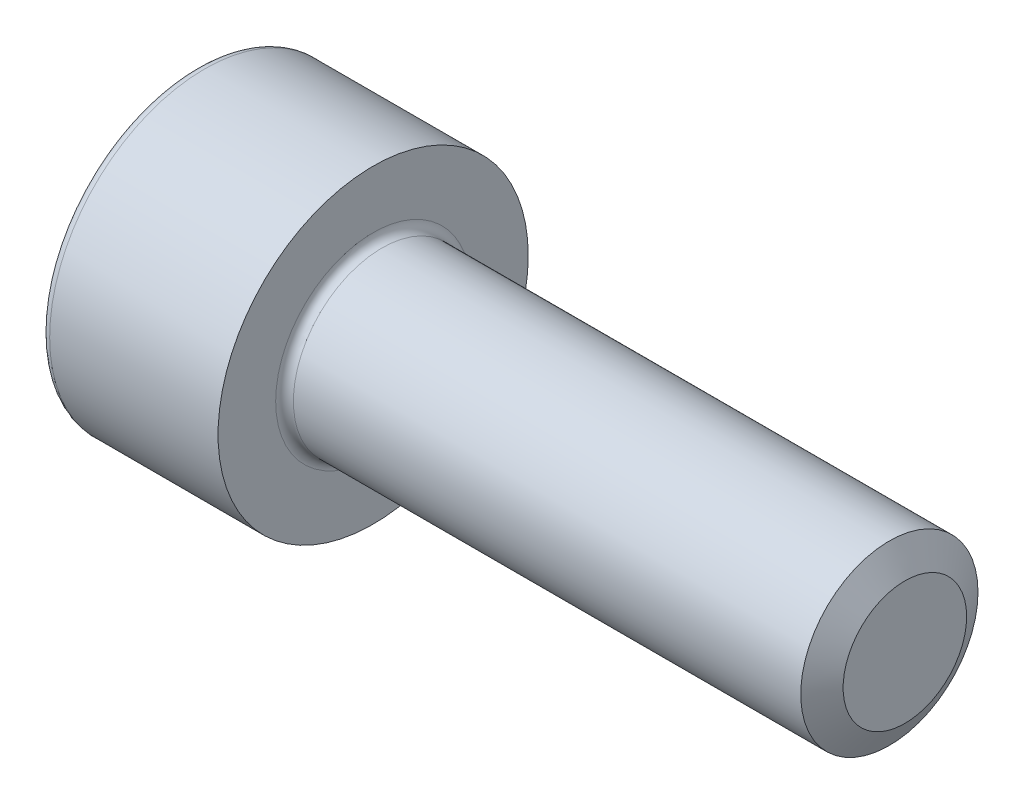
ISO-10303-21;
HEADER;
FILE_DESCRIPTION(('STEP AP214'),'2;1');
FILE_NAME('part.step','',(''),(''),'','','');
FILE_SCHEMA(('AUTOMOTIVE_DESIGN { 1 0 10303 214 1 1 1 1 }'));
ENDSEC;
DATA;
#1=APPLICATION_CONTEXT('core data for automotive mechanical design processes');
#2=APPLICATION_PROTOCOL_DEFINITION('international standard','automotive_design',2000,#1);
#3=PRODUCT_CONTEXT('',#1,'mechanical');
#4=PRODUCT('Part','Part','',(#3));
#5=PRODUCT_RELATED_PRODUCT_CATEGORY('part','',(#4));
#6=PRODUCT_DEFINITION_FORMATION('','',#4);
#7=PRODUCT_DEFINITION_CONTEXT('part definition',#1,'design');
#8=PRODUCT_DEFINITION('design','',#6,#7);
#9=PRODUCT_DEFINITION_SHAPE('','',#8);
#10=(LENGTH_UNIT() NAMED_UNIT(*) SI_UNIT(.MILLI.,.METRE.));
#11=(NAMED_UNIT(*) PLANE_ANGLE_UNIT() SI_UNIT($,.RADIAN.));
#12=(NAMED_UNIT(*) SI_UNIT($,.STERADIAN.) SOLID_ANGLE_UNIT());
#13=UNCERTAINTY_MEASURE_WITH_UNIT(LENGTH_MEASURE(1.E-05),#10,'distance_accuracy_value','');
#14=(GEOMETRIC_REPRESENTATION_CONTEXT(3) GLOBAL_UNCERTAINTY_ASSIGNED_CONTEXT((#13)) GLOBAL_UNIT_ASSIGNED_CONTEXT((#10,
#11,#12)) REPRESENTATION_CONTEXT('',''));
#15=CARTESIAN_POINT('',(0.,0.,0.));
#16=DIRECTION('',(0.,0.,1.));
#17=DIRECTION('',(1.,0.,0.));
#18=AXIS2_PLACEMENT_3D('',#15,#16,#17);
#19=CARTESIAN_POINT('',(0.,0.,0.));
#20=DIRECTION('',(1.,0.,0.));
#21=DIRECTION('',(0.,0.,-1.));
#22=AXIS2_PLACEMENT_3D('',#19,#20,#21);
#23=CYLINDRICAL_SURFACE('',#22,3.5);
#24=CARTESIAN_POINT('',(0.2,0.,0.));
#25=DIRECTION('',(-1.,0.,0.));
#26=DIRECTION('',(0.,0.,1.));
#27=AXIS2_PLACEMENT_3D('',#24,#25,#26);
#28=CIRCLE('',#27,3.5);
#29=CARTESIAN_POINT('',(0.2,0.,3.5));
#30=VERTEX_POINT('',#29);
#31=EDGE_CURVE('E44',#30,#30,#28,.F.);
#32=ORIENTED_EDGE('',*,*,#31,.T.);
#33=EDGE_LOOP('',(#32));
#34=FACE_BOUND('',#33,.T.);
#35=CARTESIAN_POINT('',(4.,0.,0.));
#36=DIRECTION('',(1.,0.,0.));
#37=DIRECTION('',(0.,0.,-1.));
#38=AXIS2_PLACEMENT_3D('',#35,#36,#37);
#39=CIRCLE('',#38,3.5);
#40=CARTESIAN_POINT('',(4.,0.,-3.5));
#41=VERTEX_POINT('',#40);
#42=EDGE_CURVE('E138',#41,#41,#39,.T.);
#43=ORIENTED_EDGE('',*,*,#42,.F.);
#44=EDGE_LOOP('',(#43));
#45=FACE_BOUND('',#44,.T.);
#46=ADVANCED_FACE('F36',(#34,#45),#23,.T.);
#47=CARTESIAN_POINT('',(0.,3.5,0.));
#48=DIRECTION('',(-1.,0.,0.));
#49=DIRECTION('',(0.,0.,1.));
#50=AXIS2_PLACEMENT_3D('',#47,#48,#49);
#51=PLANE('',#50);
#52=CARTESIAN_POINT('',(0.,0.,0.));
#53=DIRECTION('',(-1.,0.,0.));
#54=DIRECTION('',(0.,0.,1.));
#55=AXIS2_PLACEMENT_3D('',#52,#53,#54);
#56=CIRCLE('',#55,3.3);
#57=CARTESIAN_POINT('',(0.,0.,3.3));
#58=VERTEX_POINT('',#57);
#59=EDGE_CURVE('E11',#58,#58,#56,.T.);
#60=ORIENTED_EDGE('',*,*,#59,.T.);
#61=EDGE_LOOP('',(#60));
#62=FACE_BOUND('',#61,.T.);
#63=DIRECTION('',(0.,0.5,-0.866025403784439));
#64=VECTOR('',#63,1.);
#65=CARTESIAN_POINT('',(0.,0.860000000000001,1.48956369450923));
#66=LINE('',#65,#64);
#67=CARTESIAN_POINT('',(0.,0.860000000000001,1.48956369450923));
#68=VERTEX_POINT('',#67);
#69=CARTESIAN_POINT('',(0.,1.72,0.));
#70=VERTEX_POINT('',#69);
#71=EDGE_CURVE('E51',#68,#70,#66,.T.);
#72=ORIENTED_EDGE('',*,*,#71,.F.);
#73=DIRECTION('',(0.,1.,0.));
#74=VECTOR('',#73,1.);
#75=CARTESIAN_POINT('',(0.,-0.86,1.48956369450923));
#76=LINE('',#75,#74);
#77=CARTESIAN_POINT('',(0.,-0.86,1.48956369450923));
#78=VERTEX_POINT('',#77);
#79=EDGE_CURVE('E134',#78,#68,#76,.T.);
#80=ORIENTED_EDGE('',*,*,#79,.F.);
#81=DIRECTION('',(0.,0.5,0.866025403784439));
#82=VECTOR('',#81,1.);
#83=CARTESIAN_POINT('',(0.,-1.72,0.));
#84=LINE('',#83,#82);
#85=CARTESIAN_POINT('',(0.,-1.72,0.));
#86=VERTEX_POINT('',#85);
#87=EDGE_CURVE('E132',#86,#78,#84,.T.);
#88=ORIENTED_EDGE('',*,*,#87,.F.);
#89=DIRECTION('',(0.,-0.5,0.866025403784438));
#90=VECTOR('',#89,1.);
#91=CARTESIAN_POINT('',(0.,-0.86,-1.48956369450923));
#92=LINE('',#91,#90);
#93=CARTESIAN_POINT('',(0.,-0.86,-1.48956369450923));
#94=VERTEX_POINT('',#93);
#95=EDGE_CURVE('E99',#94,#86,#92,.T.);
#96=ORIENTED_EDGE('',*,*,#95,.F.);
#97=DIRECTION('',(0.,-1.,0.));
#98=VECTOR('',#97,1.);
#99=CARTESIAN_POINT('',(0.,0.86,-1.48956369450923));
#100=LINE('',#99,#98);
#101=CARTESIAN_POINT('',(0.,0.86,-1.48956369450923));
#102=VERTEX_POINT('',#101);
#103=EDGE_CURVE('E128',#102,#94,#100,.T.);
#104=ORIENTED_EDGE('',*,*,#103,.F.);
#105=DIRECTION('',(0.,-0.5,-0.866025403784439));
#106=VECTOR('',#105,1.);
#107=CARTESIAN_POINT('',(0.,1.72,0.));
#108=LINE('',#107,#106);
#109=EDGE_CURVE('E125',#70,#102,#108,.T.);
#110=ORIENTED_EDGE('',*,*,#109,.F.);
#111=EDGE_LOOP('',(#72,#80,#88,#96,#104,#110));
#112=FACE_BOUND('',#111,.T.);
#113=ADVANCED_FACE('F172',(#62,#112),#51,.T.);
#114=CARTESIAN_POINT('',(4.,0.,0.));
#115=DIRECTION('',(1.,0.,0.));
#116=DIRECTION('',(0.,0.,-1.));
#117=AXIS2_PLACEMENT_3D('',#114,#115,#116);
#118=PLANE('',#117);
#119=CARTESIAN_POINT('',(4.,0.,0.));
#120=DIRECTION('',(1.,0.,0.));
#121=DIRECTION('',(0.,0.,-1.));
#122=AXIS2_PLACEMENT_3D('',#119,#120,#121);
#123=CIRCLE('',#122,2.2);
#124=CARTESIAN_POINT('',(4.,0.,-2.2));
#125=VERTEX_POINT('',#124);
#126=EDGE_CURVE('E155',#125,#125,#123,.F.);
#127=ORIENTED_EDGE('',*,*,#126,.T.);
#128=EDGE_LOOP('',(#127));
#129=FACE_BOUND('',#128,.T.);
#130=ORIENTED_EDGE('',*,*,#42,.T.);
#131=EDGE_LOOP('',(#130));
#132=FACE_BOUND('',#131,.T.);
#133=ADVANCED_FACE('F177',(#129,#132),#118,.T.);
#134=CARTESIAN_POINT('',(16.,0.,0.));
#135=DIRECTION('',(-1.,0.,0.));
#136=DIRECTION('',(0.,0.,1.));
#137=AXIS2_PLACEMENT_3D('',#134,#135,#136);
#138=CYLINDRICAL_SURFACE('',#137,2.);
#139=CARTESIAN_POINT('',(4.2,0.,0.));
#140=DIRECTION('',(1.,0.,0.));
#141=DIRECTION('',(0.,0.,-1.));
#142=AXIS2_PLACEMENT_3D('',#139,#140,#141);
#143=CIRCLE('',#142,2.);
#144=CARTESIAN_POINT('',(4.2,0.,-2.));
#145=VERTEX_POINT('',#144);
#146=EDGE_CURVE('E152',#145,#145,#143,.T.);
#147=ORIENTED_EDGE('',*,*,#146,.T.);
#148=EDGE_LOOP('',(#147));
#149=FACE_BOUND('',#148,.T.);
#150=CARTESIAN_POINT('',(15.6500000000051,0.,0.));
#151=DIRECTION('',(1.,0.,0.));
#152=DIRECTION('',(0.,0.,-1.));
#153=AXIS2_PLACEMENT_3D('',#150,#151,#152);
#154=CIRCLE('',#153,2.);
#155=CARTESIAN_POINT('',(15.6500000000051,0.,-2.));
#156=VERTEX_POINT('',#155);
#157=EDGE_CURVE('E149',#156,#156,#154,.F.);
#158=ORIENTED_EDGE('',*,*,#157,.T.);
#159=EDGE_LOOP('',(#158));
#160=FACE_BOUND('',#159,.T.);
#161=ADVANCED_FACE('F199',(#149,#160),#138,.T.);
#162=CARTESIAN_POINT('',(16.,0.,0.));
#163=DIRECTION('',(1.,0.,0.));
#164=DIRECTION('',(0.,0.,-1.));
#165=AXIS2_PLACEMENT_3D('',#162,#163,#164);
#166=PLANE('',#165);
#167=CARTESIAN_POINT('',(16.,0.,0.));
#168=DIRECTION('',(1.,0.,0.));
#169=DIRECTION('',(0.,0.,-1.));
#170=AXIS2_PLACEMENT_3D('',#167,#168,#169);
#171=CIRCLE('',#170,1.39380000004539);
#172=CARTESIAN_POINT('',(16.,0.,-1.39380000004539));
#173=VERTEX_POINT('',#172);
#174=EDGE_CURVE('E146',#173,#173,#171,.T.);
#175=ORIENTED_EDGE('',*,*,#174,.T.);
#176=EDGE_LOOP('',(#175));
#177=FACE_BOUND('',#176,.T.);
#178=ADVANCED_FACE('F196',(#177),#166,.T.);
#179=CARTESIAN_POINT('',(2.,0.860000000000001,1.48956369450923));
#180=DIRECTION('',(0.,0.866025403784439,0.5));
#181=DIRECTION('',(0.,-0.5,0.866025403784439));
#182=AXIS2_PLACEMENT_3D('',#179,#180,#181);
#183=PLANE('',#182);
#184=ORIENTED_EDGE('',*,*,#71,.T.);
#185=DIRECTION('',(-1.,0.,0.));
#186=VECTOR('',#185,1.);
#187=CARTESIAN_POINT('',(2.,1.72,0.));
#188=LINE('',#187,#186);
#189=CARTESIAN_POINT('',(2.,1.72,0.));
#190=VERTEX_POINT('',#189);
#191=EDGE_CURVE('E81',#190,#70,#188,.T.);
#192=ORIENTED_EDGE('',*,*,#191,.F.);
#193=DIRECTION('',(0.,0.5,-0.866025403784439));
#194=VECTOR('',#193,1.);
#195=CARTESIAN_POINT('',(2.,0.860000000000001,1.48956369450923));
#196=LINE('',#195,#194);
#197=CARTESIAN_POINT('',(2.,0.860000000000001,1.48956369450923));
#198=VERTEX_POINT('',#197);
#199=EDGE_CURVE('E136',#198,#190,#196,.T.);
#200=ORIENTED_EDGE('',*,*,#199,.F.);
#201=DIRECTION('',(-1.,0.,0.));
#202=VECTOR('',#201,1.);
#203=CARTESIAN_POINT('',(2.,0.860000000000001,1.48956369450923));
#204=LINE('',#203,#202);
#205=EDGE_CURVE('E59',#198,#68,#204,.T.);
#206=ORIENTED_EDGE('',*,*,#205,.T.);
#207=EDGE_LOOP('',(#184,#192,#200,#206));
#208=FACE_BOUND('',#207,.T.);
#209=ADVANCED_FACE('F198',(#208),#183,.F.);
#210=CARTESIAN_POINT('',(2.,-0.86,1.48956369450923));
#211=DIRECTION('',(0.,0.,1.));
#212=DIRECTION('',(0.,-1.,0.));
#213=AXIS2_PLACEMENT_3D('',#210,#211,#212);
#214=PLANE('',#213);
#215=ORIENTED_EDGE('',*,*,#79,.T.);
#216=ORIENTED_EDGE('',*,*,#205,.F.);
#217=DIRECTION('',(0.,1.,0.));
#218=VECTOR('',#217,1.);
#219=CARTESIAN_POINT('',(2.,-0.86,1.48956369450923));
#220=LINE('',#219,#218);
#221=CARTESIAN_POINT('',(2.,-0.86,1.48956369450923));
#222=VERTEX_POINT('',#221);
#223=EDGE_CURVE('E111',#222,#198,#220,.T.);
#224=ORIENTED_EDGE('',*,*,#223,.F.);
#225=DIRECTION('',(-1.,0.,0.));
#226=VECTOR('',#225,1.);
#227=CARTESIAN_POINT('',(2.,-0.86,1.48956369450923));
#228=LINE('',#227,#226);
#229=EDGE_CURVE('E103',#222,#78,#228,.T.);
#230=ORIENTED_EDGE('',*,*,#229,.T.);
#231=EDGE_LOOP('',(#215,#216,#224,#230));
#232=FACE_BOUND('',#231,.T.);
#233=ADVANCED_FACE('F205',(#232),#214,.F.);
#234=CARTESIAN_POINT('',(2.,-1.72,0.));
#235=DIRECTION('',(0.,-0.866025403784439,0.5));
#236=DIRECTION('',(0.,-0.5,-0.866025403784439));
#237=AXIS2_PLACEMENT_3D('',#234,#235,#236);
#238=PLANE('',#237);
#239=ORIENTED_EDGE('',*,*,#87,.T.);
#240=ORIENTED_EDGE('',*,*,#229,.F.);
#241=DIRECTION('',(0.,0.5,0.866025403784439));
#242=VECTOR('',#241,1.);
#243=CARTESIAN_POINT('',(2.,-1.72,0.));
#244=LINE('',#243,#242);
#245=CARTESIAN_POINT('',(2.,-1.72,0.));
#246=VERTEX_POINT('',#245);
#247=EDGE_CURVE('E107',#246,#222,#244,.T.);
#248=ORIENTED_EDGE('',*,*,#247,.F.);
#249=DIRECTION('',(-1.,0.,0.));
#250=VECTOR('',#249,1.);
#251=CARTESIAN_POINT('',(2.,-1.72,0.));
#252=LINE('',#251,#250);
#253=EDGE_CURVE('E92',#246,#86,#252,.T.);
#254=ORIENTED_EDGE('',*,*,#253,.T.);
#255=EDGE_LOOP('',(#239,#240,#248,#254));
#256=FACE_BOUND('',#255,.T.);
#257=ADVANCED_FACE('F108',(#256),#238,.F.);
#258=CARTESIAN_POINT('',(2.,-0.86,-1.48956369450923));
#259=DIRECTION('',(0.,-0.866025403784439,-0.5));
#260=DIRECTION('',(0.,0.5,-0.866025403784438));
#261=AXIS2_PLACEMENT_3D('',#258,#259,#260);
#262=PLANE('',#261);
#263=ORIENTED_EDGE('',*,*,#95,.T.);
#264=ORIENTED_EDGE('',*,*,#253,.F.);
#265=DIRECTION('',(0.,-0.5,0.866025403784438));
#266=VECTOR('',#265,1.);
#267=CARTESIAN_POINT('',(2.,-0.86,-1.48956369450923));
#268=LINE('',#267,#266);
#269=CARTESIAN_POINT('',(2.,-0.86,-1.48956369450923));
#270=VERTEX_POINT('',#269);
#271=EDGE_CURVE('E96',#270,#246,#268,.T.);
#272=ORIENTED_EDGE('',*,*,#271,.F.);
#273=DIRECTION('',(-1.,0.,0.));
#274=VECTOR('',#273,1.);
#275=CARTESIAN_POINT('',(2.,-0.86,-1.48956369450923));
#276=LINE('',#275,#274);
#277=EDGE_CURVE('E104',#270,#94,#276,.T.);
#278=ORIENTED_EDGE('',*,*,#277,.T.);
#279=EDGE_LOOP('',(#263,#264,#272,#278));
#280=FACE_BOUND('',#279,.T.);
#281=ADVANCED_FACE('F94',(#280),#262,.F.);
#282=CARTESIAN_POINT('',(2.,0.86,-1.48956369450923));
#283=DIRECTION('',(0.,0.,-1.));
#284=DIRECTION('',(0.,1.,0.));
#285=AXIS2_PLACEMENT_3D('',#282,#283,#284);
#286=PLANE('',#285);
#287=ORIENTED_EDGE('',*,*,#103,.T.);
#288=ORIENTED_EDGE('',*,*,#277,.F.);
#289=DIRECTION('',(0.,-1.,0.));
#290=VECTOR('',#289,1.);
#291=CARTESIAN_POINT('',(2.,0.86,-1.48956369450923));
#292=LINE('',#291,#290);
#293=CARTESIAN_POINT('',(2.,0.86,-1.48956369450923));
#294=VERTEX_POINT('',#293);
#295=EDGE_CURVE('E117',#294,#270,#292,.T.);
#296=ORIENTED_EDGE('',*,*,#295,.F.);
#297=DIRECTION('',(-1.,0.,0.));
#298=VECTOR('',#297,1.);
#299=CARTESIAN_POINT('',(2.,0.86,-1.48956369450923));
#300=LINE('',#299,#298);
#301=EDGE_CURVE('E141',#294,#102,#300,.T.);
#302=ORIENTED_EDGE('',*,*,#301,.T.);
#303=EDGE_LOOP('',(#287,#288,#296,#302));
#304=FACE_BOUND('',#303,.T.);
#305=ADVANCED_FACE('F256',(#304),#286,.F.);
#306=CARTESIAN_POINT('',(2.,1.72,0.));
#307=DIRECTION('',(0.,0.866025403784439,-0.5));
#308=DIRECTION('',(0.,0.5,0.866025403784439));
#309=AXIS2_PLACEMENT_3D('',#306,#307,#308);
#310=PLANE('',#309);
#311=ORIENTED_EDGE('',*,*,#109,.T.);
#312=ORIENTED_EDGE('',*,*,#301,.F.);
#313=DIRECTION('',(0.,-0.5,-0.866025403784439));
#314=VECTOR('',#313,1.);
#315=CARTESIAN_POINT('',(2.,1.72,0.));
#316=LINE('',#315,#314);
#317=EDGE_CURVE('E119',#190,#294,#316,.T.);
#318=ORIENTED_EDGE('',*,*,#317,.F.);
#319=ORIENTED_EDGE('',*,*,#191,.T.);
#320=EDGE_LOOP('',(#311,#312,#318,#319));
#321=FACE_BOUND('',#320,.T.);
#322=ADVANCED_FACE('F190',(#321),#310,.F.);
#323=CARTESIAN_POINT('',(2.,0.,0.));
#324=DIRECTION('',(-1.,0.,0.));
#325=DIRECTION('',(0.,0.,1.));
#326=AXIS2_PLACEMENT_3D('',#323,#324,#325);
#327=PLANE('',#326);
#328=ORIENTED_EDGE('',*,*,#199,.T.);
#329=ORIENTED_EDGE('',*,*,#317,.T.);
#330=ORIENTED_EDGE('',*,*,#295,.T.);
#331=ORIENTED_EDGE('',*,*,#271,.T.);
#332=ORIENTED_EDGE('',*,*,#247,.T.);
#333=ORIENTED_EDGE('',*,*,#223,.T.);
#334=EDGE_LOOP('',(#328,#329,#330,#331,#332,#333));
#335=FACE_BOUND('',#334,.T.);
#336=ADVANCED_FACE('F114',(#335),#327,.T.);
#337=CARTESIAN_POINT('',(16.,0.,0.));
#338=DIRECTION('',(-1.,0.,0.));
#339=DIRECTION('',(0.,0.,1.));
#340=AXIS2_PLACEMENT_3D('',#337,#338,#339);
#341=CONICAL_SURFACE('',#340,1.39380000004539,1.04718484899879);
#342=ORIENTED_EDGE('',*,*,#157,.F.);
#343=EDGE_LOOP('',(#342));
#344=FACE_BOUND('',#343,.T.);
#345=ORIENTED_EDGE('',*,*,#174,.F.);
#346=EDGE_LOOP('',(#345));
#347=FACE_BOUND('',#346,.T.);
#348=ADVANCED_FACE('F168',(#344,#347),#341,.T.);
#349=CARTESIAN_POINT('',(4.2,0.,0.));
#350=DIRECTION('',(1.,0.,0.));
#351=DIRECTION('',(0.,0.,-1.));
#352=AXIS2_PLACEMENT_3D('',#349,#350,#351);
#353=TOROIDAL_SURFACE('',#352,2.2,0.2);
#354=ORIENTED_EDGE('',*,*,#126,.F.);
#355=EDGE_LOOP('',(#354));
#356=FACE_BOUND('',#355,.T.);
#357=ORIENTED_EDGE('',*,*,#146,.F.);
#358=EDGE_LOOP('',(#357));
#359=FACE_BOUND('',#358,.T.);
#360=ADVANCED_FACE('F163',(#356,#359),#353,.F.);
#361=CARTESIAN_POINT('',(0.2,0.,0.));
#362=DIRECTION('',(-1.,0.,0.));
#363=DIRECTION('',(0.,0.,1.));
#364=AXIS2_PLACEMENT_3D('',#361,#362,#363);
#365=TOROIDAL_SURFACE('',#364,3.3,0.2);
#366=ORIENTED_EDGE('',*,*,#59,.F.);
#367=EDGE_LOOP('',(#366));
#368=FACE_BOUND('',#367,.T.);
#369=ORIENTED_EDGE('',*,*,#31,.F.);
#370=EDGE_LOOP('',(#369));
#371=FACE_BOUND('',#370,.T.);
#372=ADVANCED_FACE('F38',(#368,#371),#365,.T.);
#373=CLOSED_SHELL('',(#46,#113,#133,#161,#178,#209,#233,#257,#281,#305,#322,#336,#348,#360,#372));
#374=MANIFOLD_SOLID_BREP('B2',#373);
#375=ADVANCED_BREP_SHAPE_REPRESENTATION('',(#18,#374),#14);
#376=SHAPE_DEFINITION_REPRESENTATION(#9,#375);
ENDSEC;
END-ISO-10303-21;
